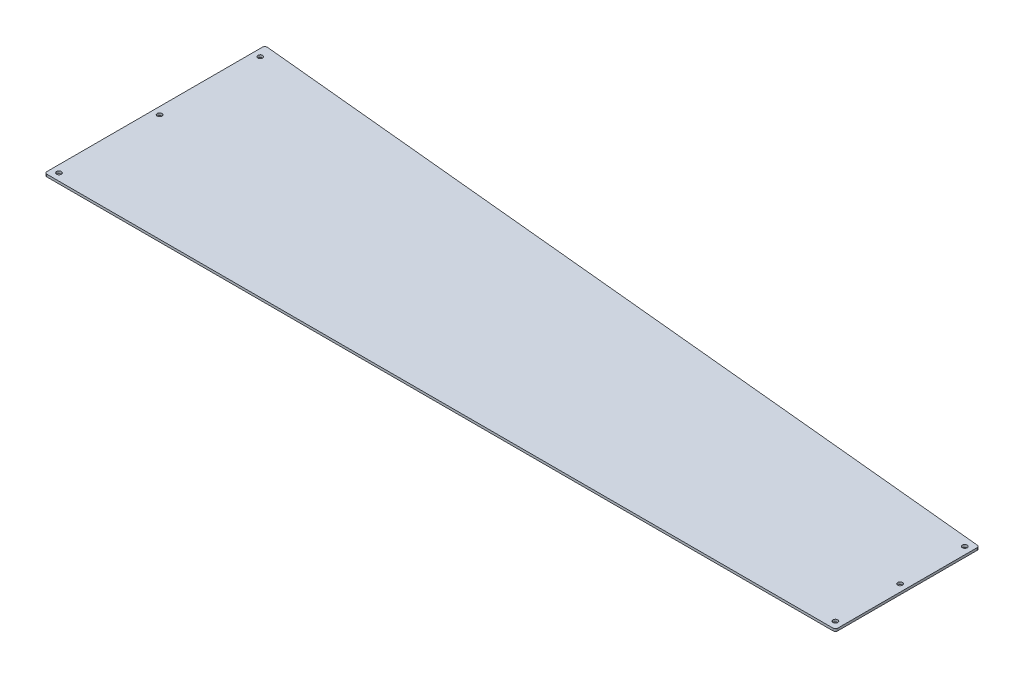
ISO-10303-21;
HEADER;
FILE_DESCRIPTION(('STEP AP214'),'2;1');
FILE_NAME('part.step','',(''),(''),'','','');
FILE_SCHEMA(('AUTOMOTIVE_DESIGN { 1 0 10303 214 1 1 1 1 }'));
ENDSEC;
DATA;
#1=APPLICATION_CONTEXT('core data for automotive mechanical design processes');
#2=APPLICATION_PROTOCOL_DEFINITION('international standard','automotive_design',2000,#1);
#3=PRODUCT_CONTEXT('',#1,'mechanical');
#4=PRODUCT('Part','Part','',(#3));
#5=PRODUCT_RELATED_PRODUCT_CATEGORY('part','',(#4));
#6=PRODUCT_DEFINITION_FORMATION('','',#4);
#7=PRODUCT_DEFINITION_CONTEXT('part definition',#1,'design');
#8=PRODUCT_DEFINITION('design','',#6,#7);
#9=PRODUCT_DEFINITION_SHAPE('','',#8);
#10=(LENGTH_UNIT() NAMED_UNIT(*) SI_UNIT(.MILLI.,.METRE.));
#11=(NAMED_UNIT(*) PLANE_ANGLE_UNIT() SI_UNIT($,.RADIAN.));
#12=(NAMED_UNIT(*) SI_UNIT($,.STERADIAN.) SOLID_ANGLE_UNIT());
#13=UNCERTAINTY_MEASURE_WITH_UNIT(LENGTH_MEASURE(1.E-05),#10,'distance_accuracy_value','');
#14=(GEOMETRIC_REPRESENTATION_CONTEXT(3) GLOBAL_UNCERTAINTY_ASSIGNED_CONTEXT((#13)) GLOBAL_UNIT_ASSIGNED_CONTEXT((#10,
#11,#12)) REPRESENTATION_CONTEXT('',''));
#15=CARTESIAN_POINT('',(0.,0.,0.));
#16=DIRECTION('',(0.,0.,1.));
#17=DIRECTION('',(1.,0.,0.));
#18=AXIS2_PLACEMENT_3D('',#15,#16,#17);
#19=CARTESIAN_POINT('',(413.585526315789,3.175,-75.1973684210526));
#20=DIRECTION('',(-1.,0.,0.));
#21=DIRECTION('',(0.,0.,1.));
#22=AXIS2_PLACEMENT_3D('',#19,#20,#21);
#23=PLANE('',#22);
#24=DIRECTION('',(0.,0.,-1.));
#25=VECTOR('',#24,1.);
#26=CARTESIAN_POINT('',(413.585526315789,3.175,-75.1973684210526));
#27=LINE('',#26,#25);
#28=CARTESIAN_POINT('',(413.585526315789,3.175,112.127631578947));
#29=VERTEX_POINT('',#28);
#30=CARTESIAN_POINT('',(413.585526315789,3.175,-72.3153546797032));
#31=VERTEX_POINT('',#30);
#32=EDGE_CURVE('E129',#29,#31,#27,.T.);
#33=ORIENTED_EDGE('',*,*,#32,.F.);
#34=DIRECTION('',(0.,-1.,0.));
#35=VECTOR('',#34,1.);
#36=CARTESIAN_POINT('',(413.585526315789,3.175,112.127631578947));
#37=LINE('',#36,#35);
#38=CARTESIAN_POINT('',(413.585526315789,0.,112.127631578947));
#39=VERTEX_POINT('',#38);
#40=EDGE_CURVE('E113',#29,#39,#37,.T.);
#41=ORIENTED_EDGE('',*,*,#40,.T.);
#42=DIRECTION('',(0.,0.,-1.));
#43=VECTOR('',#42,1.);
#44=CARTESIAN_POINT('',(413.585526315789,0.,-75.1973684210526));
#45=LINE('',#44,#43);
#46=CARTESIAN_POINT('',(413.585526315789,0.,-72.3153546797032));
#47=VERTEX_POINT('',#46);
#48=EDGE_CURVE('E126',#39,#47,#45,.T.);
#49=ORIENTED_EDGE('',*,*,#48,.T.);
#50=DIRECTION('',(0.,-1.,0.));
#51=VECTOR('',#50,1.);
#52=CARTESIAN_POINT('',(413.585526315789,3.175,-72.3153546797032));
#53=LINE('',#52,#51);
#54=EDGE_CURVE('E132',#47,#31,#53,.F.);
#55=ORIENTED_EDGE('',*,*,#54,.T.);
#56=EDGE_LOOP('',(#33,#41,#49,#55));
#57=FACE_BOUND('',#56,.T.);
#58=ADVANCED_FACE('F43',(#57),#23,.F.);
#59=CARTESIAN_POINT('',(-634.164473684211,3.175,-176.797368421053));
#60=DIRECTION('',(-0.0965169782548387,0.,0.995331338253024));
#61=DIRECTION('',(0.995331338253024,0.,0.0965169782548386));
#62=AXIS2_PLACEMENT_3D('',#59,#60,#61);
#63=PLANE('',#62);
#64=DIRECTION('',(-0.995331338253024,0.,-0.0965169782548386));
#65=VECTOR('',#64,1.);
#66=CARTESIAN_POINT('',(-634.164473684211,3.175,-176.797368421053));
#67=LINE('',#66,#65);
#68=CARTESIAN_POINT('',(410.716967721748,3.175,-75.4755316786566));
#69=VERTEX_POINT('',#68);
#70=CARTESIAN_POINT('',(-630.683032278251,3.175,-176.459774102899));
#71=VERTEX_POINT('',#70);
#72=EDGE_CURVE('E208',#69,#71,#67,.T.);
#73=ORIENTED_EDGE('',*,*,#72,.F.);
#74=DIRECTION('',(0.,-1.,0.));
#75=VECTOR('',#74,1.);
#76=CARTESIAN_POINT('',(410.716967721749,3.175,-75.4755316786566));
#77=LINE('',#76,#75);
#78=CARTESIAN_POINT('',(410.716967721748,0.,-75.4755316786566));
#79=VERTEX_POINT('',#78);
#80=EDGE_CURVE('E186',#69,#79,#77,.T.);
#81=ORIENTED_EDGE('',*,*,#80,.T.);
#82=DIRECTION('',(-0.995331338253024,0.,-0.0965169782548386));
#83=VECTOR('',#82,1.);
#84=CARTESIAN_POINT('',(-634.164473684211,0.,-176.797368421053));
#85=LINE('',#84,#83);
#86=CARTESIAN_POINT('',(-630.683032278251,0.,-176.459774102899));
#87=VERTEX_POINT('',#86);
#88=EDGE_CURVE('E137',#79,#87,#85,.T.);
#89=ORIENTED_EDGE('',*,*,#88,.T.);
#90=DIRECTION('',(0.,-1.,0.));
#91=VECTOR('',#90,1.);
#92=CARTESIAN_POINT('',(-630.683032278251,3.175,-176.459774102899));
#93=LINE('',#92,#91);
#94=EDGE_CURVE('E183',#87,#71,#93,.F.);
#95=ORIENTED_EDGE('',*,*,#94,.T.);
#96=EDGE_LOOP('',(#73,#81,#89,#95));
#97=FACE_BOUND('',#96,.T.);
#98=ADVANCED_FACE('F290',(#97),#63,.F.);
#99=CARTESIAN_POINT('',(-634.164473684211,3.175,-176.797368421053));
#100=DIRECTION('',(1.,0.,0.));
#101=DIRECTION('',(0.,0.,-1.));
#102=AXIS2_PLACEMENT_3D('',#99,#100,#101);
#103=PLANE('',#102);
#104=DIRECTION('',(0.,0.,1.));
#105=VECTOR('',#104,1.);
#106=CARTESIAN_POINT('',(-634.164473684211,0.,-176.797368421053));
#107=LINE('',#106,#105);
#108=CARTESIAN_POINT('',(-634.164473684211,0.,-173.299597103946));
#109=VERTEX_POINT('',#108);
#110=CARTESIAN_POINT('',(-634.164473684211,0.,112.127631578947));
#111=VERTEX_POINT('',#110);
#112=EDGE_CURVE('E144',#109,#111,#107,.T.);
#113=ORIENTED_EDGE('',*,*,#112,.T.);
#114=DIRECTION('',(0.,-1.,0.));
#115=VECTOR('',#114,1.);
#116=CARTESIAN_POINT('',(-634.164473684211,3.175,112.127631578947));
#117=LINE('',#116,#115);
#118=CARTESIAN_POINT('',(-634.164473684211,3.175,112.127631578947));
#119=VERTEX_POINT('',#118);
#120=EDGE_CURVE('E11',#111,#119,#117,.F.);
#121=ORIENTED_EDGE('',*,*,#120,.T.);
#122=DIRECTION('',(0.,0.,1.));
#123=VECTOR('',#122,1.);
#124=CARTESIAN_POINT('',(-634.164473684211,3.175,-176.797368421053));
#125=LINE('',#124,#123);
#126=CARTESIAN_POINT('',(-634.164473684211,3.175,-173.299597103946));
#127=VERTEX_POINT('',#126);
#128=EDGE_CURVE('E195',#127,#119,#125,.T.);
#129=ORIENTED_EDGE('',*,*,#128,.F.);
#130=DIRECTION('',(0.,-1.,0.));
#131=VECTOR('',#130,1.);
#132=CARTESIAN_POINT('',(-634.164473684211,3.175,-173.299597103946));
#133=LINE('',#132,#131);
#134=EDGE_CURVE('E52',#127,#109,#133,.T.);
#135=ORIENTED_EDGE('',*,*,#134,.T.);
#136=EDGE_LOOP('',(#113,#121,#129,#135));
#137=FACE_BOUND('',#136,.T.);
#138=ADVANCED_FACE('F194',(#137),#103,.F.);
#139=CARTESIAN_POINT('',(-634.164473684211,3.175,115.302631578947));
#140=DIRECTION('',(0.,0.,-1.));
#141=DIRECTION('',(-1.,0.,0.));
#142=AXIS2_PLACEMENT_3D('',#139,#140,#141);
#143=PLANE('',#142);
#144=DIRECTION('',(1.,0.,0.));
#145=VECTOR('',#144,1.);
#146=CARTESIAN_POINT('',(-634.164473684211,0.,115.302631578947));
#147=LINE('',#146,#145);
#148=CARTESIAN_POINT('',(-630.98947368421,0.,115.302631578947));
#149=VERTEX_POINT('',#148);
#150=CARTESIAN_POINT('',(410.41052631579,0.,115.302631578947));
#151=VERTEX_POINT('',#150);
#152=EDGE_CURVE('E155',#149,#151,#147,.T.);
#153=ORIENTED_EDGE('',*,*,#152,.T.);
#154=DIRECTION('',(0.,-1.,0.));
#155=VECTOR('',#154,1.);
#156=CARTESIAN_POINT('',(410.41052631579,3.175,115.302631578947));
#157=LINE('',#156,#155);
#158=CARTESIAN_POINT('',(410.41052631579,3.175,115.302631578947));
#159=VERTEX_POINT('',#158);
#160=EDGE_CURVE('E114',#151,#159,#157,.F.);
#161=ORIENTED_EDGE('',*,*,#160,.T.);
#162=DIRECTION('',(1.,0.,0.));
#163=VECTOR('',#162,1.);
#164=CARTESIAN_POINT('',(-634.164473684211,3.175,115.302631578947));
#165=LINE('',#164,#163);
#166=CARTESIAN_POINT('',(-630.98947368421,3.175,115.302631578947));
#167=VERTEX_POINT('',#166);
#168=EDGE_CURVE('E150',#167,#159,#165,.T.);
#169=ORIENTED_EDGE('',*,*,#168,.F.);
#170=DIRECTION('',(0.,-1.,0.));
#171=VECTOR('',#170,1.);
#172=CARTESIAN_POINT('',(-630.98947368421,3.175,115.302631578947));
#173=LINE('',#172,#171);
#174=EDGE_CURVE('E120',#167,#149,#173,.T.);
#175=ORIENTED_EDGE('',*,*,#174,.T.);
#176=EDGE_LOOP('',(#153,#161,#169,#175));
#177=FACE_BOUND('',#176,.T.);
#178=ADVANCED_FACE('F203',(#177),#143,.F.);
#179=CARTESIAN_POINT('',(0.,3.175,0.));
#180=DIRECTION('',(0.,1.,0.));
#181=DIRECTION('',(0.,0.,1.));
#182=AXIS2_PLACEMENT_3D('',#179,#180,#181);
#183=PLANE('',#182);
#184=CARTESIAN_POINT('',(404.06052631579,3.175,-65.6723684210526));
#185=DIRECTION('',(0.,1.,0.));
#186=DIRECTION('',(0.,0.,1.));
#187=AXIS2_PLACEMENT_3D('',#184,#185,#186);
#188=CIRCLE('',#187,3.17499999999998);
#189=CARTESIAN_POINT('',(404.06052631579,3.175,-62.4973684210526));
#190=VERTEX_POINT('',#189);
#191=EDGE_CURVE('E254',#190,#190,#188,.T.);
#192=ORIENTED_EDGE('',*,*,#191,.F.);
#193=EDGE_LOOP('',(#192));
#194=FACE_BOUND('',#193,.T.);
#195=CARTESIAN_POINT('',(404.06052631579,3.175,20.0526315789474));
#196=DIRECTION('',(0.,1.,0.));
#197=DIRECTION('',(0.,0.,1.));
#198=AXIS2_PLACEMENT_3D('',#195,#196,#197);
#199=CIRCLE('',#198,3.17499999999998);
#200=CARTESIAN_POINT('',(404.06052631579,3.175,23.2276315789474));
#201=VERTEX_POINT('',#200);
#202=EDGE_CURVE('E246',#201,#201,#199,.T.);
#203=ORIENTED_EDGE('',*,*,#202,.F.);
#204=EDGE_LOOP('',(#203));
#205=FACE_BOUND('',#204,.T.);
#206=CARTESIAN_POINT('',(404.06052631579,3.175,105.777631578947));
#207=DIRECTION('',(0.,1.,0.));
#208=DIRECTION('',(0.,0.,1.));
#209=AXIS2_PLACEMENT_3D('',#206,#207,#208);
#210=CIRCLE('',#209,3.17499999999998);
#211=CARTESIAN_POINT('',(404.06052631579,3.175,108.952631578947));
#212=VERTEX_POINT('',#211);
#213=EDGE_CURVE('E238',#212,#212,#210,.T.);
#214=ORIENTED_EDGE('',*,*,#213,.F.);
#215=EDGE_LOOP('',(#214));
#216=FACE_BOUND('',#215,.T.);
#217=CARTESIAN_POINT('',(-624.63947368421,3.175,105.777631578947));
#218=DIRECTION('',(0.,1.,0.));
#219=DIRECTION('',(0.,0.,1.));
#220=AXIS2_PLACEMENT_3D('',#217,#218,#219);
#221=CIRCLE('',#220,3.17500000000004);
#222=CARTESIAN_POINT('',(-624.63947368421,3.175,108.952631578947));
#223=VERTEX_POINT('',#222);
#224=EDGE_CURVE('E230',#223,#223,#221,.T.);
#225=ORIENTED_EDGE('',*,*,#224,.F.);
#226=EDGE_LOOP('',(#225));
#227=FACE_BOUND('',#226,.T.);
#228=CARTESIAN_POINT('',(-624.63947368421,3.175,-27.5723684210527));
#229=DIRECTION('',(0.,1.,0.));
#230=DIRECTION('',(0.,0.,1.));
#231=AXIS2_PLACEMENT_3D('',#228,#229,#230);
#232=CIRCLE('',#231,3.17500000000004);
#233=CARTESIAN_POINT('',(-624.63947368421,3.175,-24.3973684210526));
#234=VERTEX_POINT('',#233);
#235=EDGE_CURVE('E222',#234,#234,#232,.T.);
#236=ORIENTED_EDGE('',*,*,#235,.F.);
#237=EDGE_LOOP('',(#236));
#238=FACE_BOUND('',#237,.T.);
#239=CARTESIAN_POINT('',(-624.63947368421,3.175,-160.922368421053));
#240=DIRECTION('',(0.,1.,0.));
#241=DIRECTION('',(0.,0.,1.));
#242=AXIS2_PLACEMENT_3D('',#239,#240,#241);
#243=CIRCLE('',#242,3.17500000000004);
#244=CARTESIAN_POINT('',(-624.63947368421,3.175,-157.747368421053));
#245=VERTEX_POINT('',#244);
#246=EDGE_CURVE('E147',#245,#245,#243,.T.);
#247=ORIENTED_EDGE('',*,*,#246,.F.);
#248=EDGE_LOOP('',(#247));
#249=FACE_BOUND('',#248,.T.);
#250=ORIENTED_EDGE('',*,*,#168,.T.);
#251=CARTESIAN_POINT('',(410.41052631579,3.175,112.127631578947));
#252=DIRECTION('',(0.,1.,0.));
#253=DIRECTION('',(0.,0.,1.));
#254=AXIS2_PLACEMENT_3D('',#251,#252,#253);
#255=CIRCLE('',#254,3.175);
#256=EDGE_CURVE('E180',#159,#29,#255,.T.);
#257=ORIENTED_EDGE('',*,*,#256,.T.);
#258=ORIENTED_EDGE('',*,*,#32,.T.);
#259=CARTESIAN_POINT('',(410.410526315789,3.175,-72.3153546797032));
#260=DIRECTION('',(0.,1.,0.));
#261=DIRECTION('',(0.,0.,1.));
#262=AXIS2_PLACEMENT_3D('',#259,#260,#261);
#263=CIRCLE('',#262,3.175);
#264=EDGE_CURVE('E177',#31,#69,#263,.T.);
#265=ORIENTED_EDGE('',*,*,#264,.T.);
#266=ORIENTED_EDGE('',*,*,#72,.T.);
#267=CARTESIAN_POINT('',(-630.98947368421,3.175,-173.299597103946));
#268=DIRECTION('',(0.,1.,0.));
#269=DIRECTION('',(0.,0.,1.));
#270=AXIS2_PLACEMENT_3D('',#267,#268,#269);
#271=CIRCLE('',#270,3.175);
#272=EDGE_CURVE('E64',#71,#127,#271,.T.);
#273=ORIENTED_EDGE('',*,*,#272,.T.);
#274=ORIENTED_EDGE('',*,*,#128,.T.);
#275=CARTESIAN_POINT('',(-630.98947368421,3.175,112.127631578947));
#276=DIRECTION('',(0.,1.,0.));
#277=DIRECTION('',(0.,0.,1.));
#278=AXIS2_PLACEMENT_3D('',#275,#276,#277);
#279=CIRCLE('',#278,3.175);
#280=EDGE_CURVE('E174',#119,#167,#279,.T.);
#281=ORIENTED_EDGE('',*,*,#280,.T.);
#282=EDGE_LOOP('',(#250,#257,#258,#265,#266,#273,#274,#281));
#283=FACE_BOUND('',#282,.T.);
#284=ADVANCED_FACE('F262',(#194,#205,#216,#227,#238,#249,#283),#183,.T.);
#285=CARTESIAN_POINT('',(0.,0.,0.));
#286=DIRECTION('',(0.,1.,0.));
#287=DIRECTION('',(0.,0.,1.));
#288=AXIS2_PLACEMENT_3D('',#285,#286,#287);
#289=PLANE('',#288);
#290=CARTESIAN_POINT('',(404.06052631579,0.,-65.6723684210526));
#291=DIRECTION('',(0.,1.,0.));
#292=DIRECTION('',(0.,0.,1.));
#293=AXIS2_PLACEMENT_3D('',#290,#291,#292);
#294=CIRCLE('',#293,3.17499999999998);
#295=CARTESIAN_POINT('',(404.06052631579,0.,-62.4973684210526));
#296=VERTEX_POINT('',#295);
#297=EDGE_CURVE('E250',#296,#296,#294,.T.);
#298=ORIENTED_EDGE('',*,*,#297,.T.);
#299=EDGE_LOOP('',(#298));
#300=FACE_BOUND('',#299,.T.);
#301=CARTESIAN_POINT('',(404.06052631579,0.,20.0526315789474));
#302=DIRECTION('',(0.,1.,0.));
#303=DIRECTION('',(0.,0.,1.));
#304=AXIS2_PLACEMENT_3D('',#301,#302,#303);
#305=CIRCLE('',#304,3.17499999999998);
#306=CARTESIAN_POINT('',(404.06052631579,0.,23.2276315789474));
#307=VERTEX_POINT('',#306);
#308=EDGE_CURVE('E242',#307,#307,#305,.T.);
#309=ORIENTED_EDGE('',*,*,#308,.T.);
#310=EDGE_LOOP('',(#309));
#311=FACE_BOUND('',#310,.T.);
#312=CARTESIAN_POINT('',(404.06052631579,0.,105.777631578947));
#313=DIRECTION('',(0.,1.,0.));
#314=DIRECTION('',(0.,0.,1.));
#315=AXIS2_PLACEMENT_3D('',#312,#313,#314);
#316=CIRCLE('',#315,3.17499999999998);
#317=CARTESIAN_POINT('',(404.06052631579,0.,108.952631578947));
#318=VERTEX_POINT('',#317);
#319=EDGE_CURVE('E234',#318,#318,#316,.T.);
#320=ORIENTED_EDGE('',*,*,#319,.T.);
#321=EDGE_LOOP('',(#320));
#322=FACE_BOUND('',#321,.T.);
#323=CARTESIAN_POINT('',(-624.63947368421,0.,105.777631578947));
#324=DIRECTION('',(0.,1.,0.));
#325=DIRECTION('',(0.,0.,1.));
#326=AXIS2_PLACEMENT_3D('',#323,#324,#325);
#327=CIRCLE('',#326,3.17500000000004);
#328=CARTESIAN_POINT('',(-624.63947368421,0.,108.952631578947));
#329=VERTEX_POINT('',#328);
#330=EDGE_CURVE('E226',#329,#329,#327,.T.);
#331=ORIENTED_EDGE('',*,*,#330,.T.);
#332=EDGE_LOOP('',(#331));
#333=FACE_BOUND('',#332,.T.);
#334=CARTESIAN_POINT('',(-624.63947368421,0.,-27.5723684210527));
#335=DIRECTION('',(0.,1.,0.));
#336=DIRECTION('',(0.,0.,1.));
#337=AXIS2_PLACEMENT_3D('',#334,#335,#336);
#338=CIRCLE('',#337,3.17500000000004);
#339=CARTESIAN_POINT('',(-624.63947368421,0.,-24.3973684210526));
#340=VERTEX_POINT('',#339);
#341=EDGE_CURVE('E218',#340,#340,#338,.T.);
#342=ORIENTED_EDGE('',*,*,#341,.T.);
#343=EDGE_LOOP('',(#342));
#344=FACE_BOUND('',#343,.T.);
#345=CARTESIAN_POINT('',(-624.63947368421,0.,-160.922368421053));
#346=DIRECTION('',(0.,1.,0.));
#347=DIRECTION('',(0.,0.,1.));
#348=AXIS2_PLACEMENT_3D('',#345,#346,#347);
#349=CIRCLE('',#348,3.17500000000004);
#350=CARTESIAN_POINT('',(-624.63947368421,0.,-157.747368421053));
#351=VERTEX_POINT('',#350);
#352=EDGE_CURVE('E138',#351,#351,#349,.T.);
#353=ORIENTED_EDGE('',*,*,#352,.T.);
#354=EDGE_LOOP('',(#353));
#355=FACE_BOUND('',#354,.T.);
#356=ORIENTED_EDGE('',*,*,#48,.F.);
#357=CARTESIAN_POINT('',(410.41052631579,0.,112.127631578947));
#358=DIRECTION('',(0.,1.,0.));
#359=DIRECTION('',(0.,0.,1.));
#360=AXIS2_PLACEMENT_3D('',#357,#358,#359);
#361=CIRCLE('',#360,3.175);
#362=EDGE_CURVE('E109',#39,#151,#361,.F.);
#363=ORIENTED_EDGE('',*,*,#362,.T.);
#364=ORIENTED_EDGE('',*,*,#152,.F.);
#365=CARTESIAN_POINT('',(-630.98947368421,0.,112.127631578947));
#366=DIRECTION('',(0.,1.,0.));
#367=DIRECTION('',(0.,0.,1.));
#368=AXIS2_PLACEMENT_3D('',#365,#366,#367);
#369=CIRCLE('',#368,3.175);
#370=EDGE_CURVE('E162',#149,#111,#369,.F.);
#371=ORIENTED_EDGE('',*,*,#370,.T.);
#372=ORIENTED_EDGE('',*,*,#112,.F.);
#373=CARTESIAN_POINT('',(-630.98947368421,0.,-173.299597103946));
#374=DIRECTION('',(0.,1.,0.));
#375=DIRECTION('',(0.,0.,1.));
#376=AXIS2_PLACEMENT_3D('',#373,#374,#375);
#377=CIRCLE('',#376,3.175);
#378=EDGE_CURVE('E131',#109,#87,#377,.F.);
#379=ORIENTED_EDGE('',*,*,#378,.T.);
#380=ORIENTED_EDGE('',*,*,#88,.F.);
#381=CARTESIAN_POINT('',(410.410526315789,0.,-72.3153546797032));
#382=DIRECTION('',(0.,1.,0.));
#383=DIRECTION('',(0.,0.,1.));
#384=AXIS2_PLACEMENT_3D('',#381,#382,#383);
#385=CIRCLE('',#384,3.175);
#386=EDGE_CURVE('E121',#79,#47,#385,.F.);
#387=ORIENTED_EDGE('',*,*,#386,.T.);
#388=EDGE_LOOP('',(#356,#363,#364,#371,#372,#379,#380,#387));
#389=FACE_BOUND('',#388,.T.);
#390=ADVANCED_FACE('F134',(#300,#311,#322,#333,#344,#355,#389),#289,.F.);
#391=CARTESIAN_POINT('',(410.41052631579,3.175,112.127631578947));
#392=DIRECTION('',(0.,-1.,0.));
#393=DIRECTION('',(0.,0.,-1.));
#394=AXIS2_PLACEMENT_3D('',#391,#392,#393);
#395=CYLINDRICAL_SURFACE('',#394,3.175);
#396=ORIENTED_EDGE('',*,*,#256,.F.);
#397=ORIENTED_EDGE('',*,*,#160,.F.);
#398=ORIENTED_EDGE('',*,*,#362,.F.);
#399=ORIENTED_EDGE('',*,*,#40,.F.);
#400=EDGE_LOOP('',(#396,#397,#398,#399));
#401=FACE_BOUND('',#400,.T.);
#402=ADVANCED_FACE('F112',(#401),#395,.T.);
#403=CARTESIAN_POINT('',(410.410526315789,3.175,-72.3153546797032));
#404=DIRECTION('',(0.,-1.,0.));
#405=DIRECTION('',(0.,0.,-1.));
#406=AXIS2_PLACEMENT_3D('',#403,#404,#405);
#407=CYLINDRICAL_SURFACE('',#406,3.175);
#408=ORIENTED_EDGE('',*,*,#264,.F.);
#409=ORIENTED_EDGE('',*,*,#54,.F.);
#410=ORIENTED_EDGE('',*,*,#386,.F.);
#411=ORIENTED_EDGE('',*,*,#80,.F.);
#412=EDGE_LOOP('',(#408,#409,#410,#411));
#413=FACE_BOUND('',#412,.T.);
#414=ADVANCED_FACE('F301',(#413),#407,.T.);
#415=CARTESIAN_POINT('',(-630.98947368421,3.175,112.127631578947));
#416=DIRECTION('',(0.,-1.,0.));
#417=DIRECTION('',(0.,0.,-1.));
#418=AXIS2_PLACEMENT_3D('',#415,#416,#417);
#419=CYLINDRICAL_SURFACE('',#418,3.175);
#420=ORIENTED_EDGE('',*,*,#280,.F.);
#421=ORIENTED_EDGE('',*,*,#120,.F.);
#422=ORIENTED_EDGE('',*,*,#370,.F.);
#423=ORIENTED_EDGE('',*,*,#174,.F.);
#424=EDGE_LOOP('',(#420,#421,#422,#423));
#425=FACE_BOUND('',#424,.T.);
#426=ADVANCED_FACE('F200',(#425),#419,.T.);
#427=CARTESIAN_POINT('',(-630.98947368421,3.175,-173.299597103946));
#428=DIRECTION('',(0.,-1.,0.));
#429=DIRECTION('',(0.,0.,-1.));
#430=AXIS2_PLACEMENT_3D('',#427,#428,#429);
#431=CYLINDRICAL_SURFACE('',#430,3.175);
#432=ORIENTED_EDGE('',*,*,#272,.F.);
#433=ORIENTED_EDGE('',*,*,#94,.F.);
#434=ORIENTED_EDGE('',*,*,#378,.F.);
#435=ORIENTED_EDGE('',*,*,#134,.F.);
#436=EDGE_LOOP('',(#432,#433,#434,#435));
#437=FACE_BOUND('',#436,.T.);
#438=ADVANCED_FACE('F45',(#437),#431,.T.);
#439=CARTESIAN_POINT('',(-624.63947368421,3.175,-160.922368421053));
#440=DIRECTION('',(0.,1.,0.));
#441=DIRECTION('',(0.,0.,1.));
#442=AXIS2_PLACEMENT_3D('',#439,#440,#441);
#443=CYLINDRICAL_SURFACE('',#442,3.17500000000004);
#444=ORIENTED_EDGE('',*,*,#352,.F.);
#445=EDGE_LOOP('',(#444));
#446=FACE_BOUND('',#445,.T.);
#447=ORIENTED_EDGE('',*,*,#246,.T.);
#448=EDGE_LOOP('',(#447));
#449=FACE_BOUND('',#448,.T.);
#450=ADVANCED_FACE('F276',(#446,#449),#443,.F.);
#451=CARTESIAN_POINT('',(-624.63947368421,3.175,-27.5723684210527));
#452=DIRECTION('',(0.,1.,0.));
#453=DIRECTION('',(0.,0.,1.));
#454=AXIS2_PLACEMENT_3D('',#451,#452,#453);
#455=CYLINDRICAL_SURFACE('',#454,3.17500000000004);
#456=ORIENTED_EDGE('',*,*,#341,.F.);
#457=EDGE_LOOP('',(#456));
#458=FACE_BOUND('',#457,.T.);
#459=ORIENTED_EDGE('',*,*,#235,.T.);
#460=EDGE_LOOP('',(#459));
#461=FACE_BOUND('',#460,.T.);
#462=ADVANCED_FACE('F278',(#458,#461),#455,.F.);
#463=CARTESIAN_POINT('',(-624.63947368421,3.175,105.777631578947));
#464=DIRECTION('',(0.,1.,0.));
#465=DIRECTION('',(0.,0.,1.));
#466=AXIS2_PLACEMENT_3D('',#463,#464,#465);
#467=CYLINDRICAL_SURFACE('',#466,3.17500000000004);
#468=ORIENTED_EDGE('',*,*,#330,.F.);
#469=EDGE_LOOP('',(#468));
#470=FACE_BOUND('',#469,.T.);
#471=ORIENTED_EDGE('',*,*,#224,.T.);
#472=EDGE_LOOP('',(#471));
#473=FACE_BOUND('',#472,.T.);
#474=ADVANCED_FACE('F285',(#470,#473),#467,.F.);
#475=CARTESIAN_POINT('',(404.06052631579,3.175,105.777631578947));
#476=DIRECTION('',(0.,1.,0.));
#477=DIRECTION('',(0.,0.,1.));
#478=AXIS2_PLACEMENT_3D('',#475,#476,#477);
#479=CYLINDRICAL_SURFACE('',#478,3.17499999999998);
#480=ORIENTED_EDGE('',*,*,#319,.F.);
#481=EDGE_LOOP('',(#480));
#482=FACE_BOUND('',#481,.T.);
#483=ORIENTED_EDGE('',*,*,#213,.T.);
#484=EDGE_LOOP('',(#483));
#485=FACE_BOUND('',#484,.T.);
#486=ADVANCED_FACE('F350',(#482,#485),#479,.F.);
#487=CARTESIAN_POINT('',(404.06052631579,3.175,20.0526315789474));
#488=DIRECTION('',(0.,1.,0.));
#489=DIRECTION('',(0.,0.,1.));
#490=AXIS2_PLACEMENT_3D('',#487,#488,#489);
#491=CYLINDRICAL_SURFACE('',#490,3.17499999999998);
#492=ORIENTED_EDGE('',*,*,#308,.F.);
#493=EDGE_LOOP('',(#492));
#494=FACE_BOUND('',#493,.T.);
#495=ORIENTED_EDGE('',*,*,#202,.T.);
#496=EDGE_LOOP('',(#495));
#497=FACE_BOUND('',#496,.T.);
#498=ADVANCED_FACE('F360',(#494,#497),#491,.F.);
#499=CARTESIAN_POINT('',(404.06052631579,3.175,-65.6723684210526));
#500=DIRECTION('',(0.,1.,0.));
#501=DIRECTION('',(0.,0.,1.));
#502=AXIS2_PLACEMENT_3D('',#499,#500,#501);
#503=CYLINDRICAL_SURFACE('',#502,3.17499999999998);
#504=ORIENTED_EDGE('',*,*,#297,.F.);
#505=EDGE_LOOP('',(#504));
#506=FACE_BOUND('',#505,.T.);
#507=ORIENTED_EDGE('',*,*,#191,.T.);
#508=EDGE_LOOP('',(#507));
#509=FACE_BOUND('',#508,.T.);
#510=ADVANCED_FACE('F260',(#506,#509),#503,.F.);
#511=CLOSED_SHELL('',(#58,#98,#138,#178,#284,#390,#402,#414,#426,#438,#450,#462,#474,#486,#498,#510));
#512=MANIFOLD_SOLID_BREP('B2',#511);
#513=ADVANCED_BREP_SHAPE_REPRESENTATION('',(#18,#512),#14);
#514=SHAPE_DEFINITION_REPRESENTATION(#9,#513);
ENDSEC;
END-ISO-10303-21;
